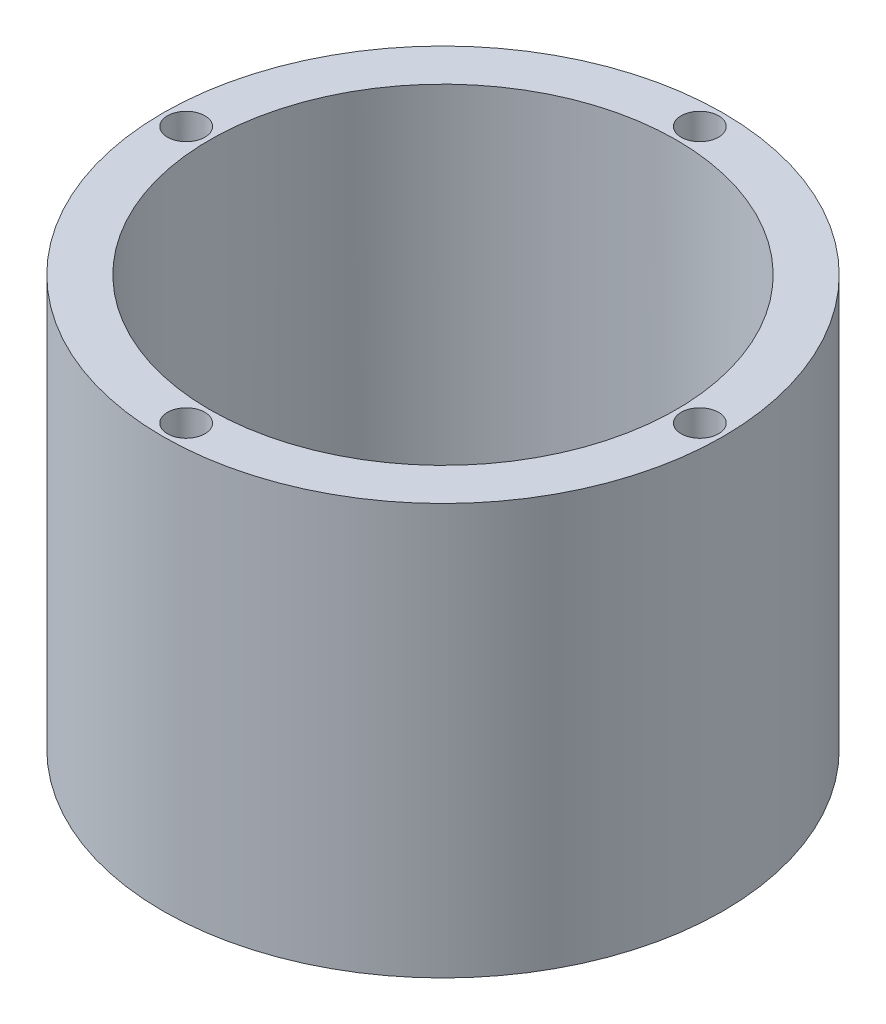
ISO-10303-21;
HEADER;
FILE_DESCRIPTION(('STEP AP214'),'2;1');
FILE_NAME('part.step','',(''),(''),'','','');
FILE_SCHEMA(('AUTOMOTIVE_DESIGN { 1 0 10303 214 1 1 1 1 }'));
ENDSEC;
DATA;
#1=APPLICATION_CONTEXT('core data for automotive mechanical design processes');
#2=APPLICATION_PROTOCOL_DEFINITION('international standard','automotive_design',2000,#1);
#3=PRODUCT_CONTEXT('',#1,'mechanical');
#4=PRODUCT('Part','Part','',(#3));
#5=PRODUCT_RELATED_PRODUCT_CATEGORY('part','',(#4));
#6=PRODUCT_DEFINITION_FORMATION('','',#4);
#7=PRODUCT_DEFINITION_CONTEXT('part definition',#1,'design');
#8=PRODUCT_DEFINITION('design','',#6,#7);
#9=PRODUCT_DEFINITION_SHAPE('','',#8);
#10=(LENGTH_UNIT() NAMED_UNIT(*) SI_UNIT(.MILLI.,.METRE.));
#11=(NAMED_UNIT(*) PLANE_ANGLE_UNIT() SI_UNIT($,.RADIAN.));
#12=(NAMED_UNIT(*) SI_UNIT($,.STERADIAN.) SOLID_ANGLE_UNIT());
#13=UNCERTAINTY_MEASURE_WITH_UNIT(LENGTH_MEASURE(1.E-05),#10,'distance_accuracy_value','');
#14=(GEOMETRIC_REPRESENTATION_CONTEXT(3) GLOBAL_UNCERTAINTY_ASSIGNED_CONTEXT((#13)) GLOBAL_UNIT_ASSIGNED_CONTEXT((#10,
#11,#12)) REPRESENTATION_CONTEXT('',''));
#15=CARTESIAN_POINT('',(0.,0.,0.));
#16=DIRECTION('',(0.,0.,1.));
#17=DIRECTION('',(1.,0.,0.));
#18=AXIS2_PLACEMENT_3D('',#15,#16,#17);
#19=CARTESIAN_POINT('',(0.,-4.,0.));
#20=DIRECTION('',(0.,1.,0.));
#21=DIRECTION('',(0.,0.,1.));
#22=AXIS2_PLACEMENT_3D('',#19,#20,#21);
#23=CYLINDRICAL_SURFACE('',#22,30.);
#24=CARTESIAN_POINT('',(0.,-4.,0.));
#25=DIRECTION('',(0.,1.,0.));
#26=DIRECTION('',(0.,0.,1.));
#27=AXIS2_PLACEMENT_3D('',#24,#25,#26);
#28=CIRCLE('',#27,30.);
#29=CARTESIAN_POINT('',(0.,-4.,30.));
#30=VERTEX_POINT('',#29);
#31=EDGE_CURVE('E48',#30,#30,#28,.T.);
#32=ORIENTED_EDGE('',*,*,#31,.T.);
#33=EDGE_LOOP('',(#32));
#34=FACE_BOUND('',#33,.T.);
#35=CARTESIAN_POINT('',(0.,40.,0.));
#36=DIRECTION('',(0.,-1.,0.));
#37=DIRECTION('',(0.,0.,-1.));
#38=AXIS2_PLACEMENT_3D('',#35,#36,#37);
#39=CIRCLE('',#38,30.);
#40=CARTESIAN_POINT('',(0.,40.,-30.));
#41=VERTEX_POINT('',#40);
#42=EDGE_CURVE('E296',#41,#41,#39,.F.);
#43=ORIENTED_EDGE('',*,*,#42,.F.);
#44=EDGE_LOOP('',(#43));
#45=FACE_BOUND('',#44,.T.);
#46=ADVANCED_FACE('F40',(#34,#45),#23,.T.);
#47=CARTESIAN_POINT('',(0.,80.,0.));
#48=DIRECTION('',(0.,1.,0.));
#49=DIRECTION('',(0.,0.,1.));
#50=AXIS2_PLACEMENT_3D('',#47,#48,#49);
#51=CYLINDRICAL_SURFACE('',#50,25.);
#52=CARTESIAN_POINT('',(0.,0.,0.));
#53=DIRECTION('',(0.,1.,0.));
#54=DIRECTION('',(0.,0.,1.));
#55=AXIS2_PLACEMENT_3D('',#52,#53,#54);
#56=CIRCLE('',#55,25.);
#57=CARTESIAN_POINT('',(0.,0.,25.));
#58=VERTEX_POINT('',#57);
#59=EDGE_CURVE('E284',#58,#58,#56,.T.);
#60=ORIENTED_EDGE('',*,*,#59,.F.);
#61=EDGE_LOOP('',(#60));
#62=FACE_BOUND('',#61,.T.);
#63=CARTESIAN_POINT('',(0.,40.,0.));
#64=DIRECTION('',(0.,-1.,0.));
#65=DIRECTION('',(0.,0.,-1.));
#66=AXIS2_PLACEMENT_3D('',#63,#64,#65);
#67=CIRCLE('',#66,25.);
#68=CARTESIAN_POINT('',(0.,40.,-25.));
#69=VERTEX_POINT('',#68);
#70=EDGE_CURVE('E310',#69,#69,#67,.F.);
#71=ORIENTED_EDGE('',*,*,#70,.T.);
#72=EDGE_LOOP('',(#71));
#73=FACE_BOUND('',#72,.T.);
#74=ADVANCED_FACE('F211',(#62,#73),#51,.F.);
#75=CARTESIAN_POINT('',(-27.5,34.,-1.92031473636372E-13));
#76=DIRECTION('',(0.,1.,0.));
#77=DIRECTION('',(0.,0.,1.));
#78=AXIS2_PLACEMENT_3D('',#75,#76,#77);
#79=CYLINDRICAL_SURFACE('',#78,2.);
#80=CARTESIAN_POINT('',(-27.5,34.,-1.92031473636372E-13));
#81=DIRECTION('',(0.,1.,0.));
#82=DIRECTION('',(0.,0.,1.));
#83=AXIS2_PLACEMENT_3D('',#80,#81,#82);
#84=CIRCLE('',#83,2.);
#85=CARTESIAN_POINT('',(-27.5,34.,1.99999999999981));
#86=VERTEX_POINT('',#85);
#87=EDGE_CURVE('E295',#86,#86,#84,.T.);
#88=ORIENTED_EDGE('',*,*,#87,.F.);
#89=EDGE_LOOP('',(#88));
#90=FACE_BOUND('',#89,.T.);
#91=CARTESIAN_POINT('',(-27.5,40.,-1.92031473636372E-13));
#92=DIRECTION('',(0.,-1.,0.));
#93=DIRECTION('',(0.,0.,-1.));
#94=AXIS2_PLACEMENT_3D('',#91,#92,#93);
#95=CIRCLE('',#94,2.);
#96=CARTESIAN_POINT('',(-27.5,40.,-2.00000000000019));
#97=VERTEX_POINT('',#96);
#98=EDGE_CURVE('E318',#97,#97,#95,.F.);
#99=ORIENTED_EDGE('',*,*,#98,.T.);
#100=EDGE_LOOP('',(#99));
#101=FACE_BOUND('',#100,.T.);
#102=ADVANCED_FACE('F215',(#90,#101),#79,.F.);
#103=CARTESIAN_POINT('',(27.5,34.,0.));
#104=DIRECTION('',(0.,1.,0.));
#105=DIRECTION('',(0.,0.,1.));
#106=AXIS2_PLACEMENT_3D('',#103,#104,#105);
#107=CYLINDRICAL_SURFACE('',#106,2.);
#108=CARTESIAN_POINT('',(27.5,34.,0.));
#109=DIRECTION('',(0.,1.,0.));
#110=DIRECTION('',(0.,0.,1.));
#111=AXIS2_PLACEMENT_3D('',#108,#109,#110);
#112=CIRCLE('',#111,2.);
#113=CARTESIAN_POINT('',(27.5,34.,2.));
#114=VERTEX_POINT('',#113);
#115=EDGE_CURVE('E290',#114,#114,#112,.T.);
#116=ORIENTED_EDGE('',*,*,#115,.F.);
#117=EDGE_LOOP('',(#116));
#118=FACE_BOUND('',#117,.T.);
#119=CARTESIAN_POINT('',(27.5,40.,0.));
#120=DIRECTION('',(0.,-1.,0.));
#121=DIRECTION('',(0.,0.,-1.));
#122=AXIS2_PLACEMENT_3D('',#119,#120,#121);
#123=CIRCLE('',#122,2.);
#124=CARTESIAN_POINT('',(27.5,40.,-2.));
#125=VERTEX_POINT('',#124);
#126=EDGE_CURVE('E11',#125,#125,#123,.F.);
#127=ORIENTED_EDGE('',*,*,#126,.T.);
#128=EDGE_LOOP('',(#127));
#129=FACE_BOUND('',#128,.T.);
#130=ADVANCED_FACE('F207',(#118,#129),#107,.F.);
#131=CARTESIAN_POINT('',(0.,0.,0.));
#132=DIRECTION('',(0.,1.,0.));
#133=DIRECTION('',(0.,0.,1.));
#134=AXIS2_PLACEMENT_3D('',#131,#132,#133);
#135=PLANE('',#134);
#136=DIRECTION('',(-0.99775519425491,0.,-0.0669669495896807));
#137=VECTOR('',#136,1.);
#138=CARTESIAN_POINT('',(1.92939965968181,0.,-3.178620376083));
#139=LINE('',#138,#137);
#140=CARTESIAN_POINT('',(18.,0.,-2.1));
#141=VERTEX_POINT('',#140);
#142=CARTESIAN_POINT('',(1.9293996596818,0.,-3.17862037608299));
#143=VERTEX_POINT('',#142);
#144=EDGE_CURVE('E55',#141,#143,#139,.T.);
#145=ORIENTED_EDGE('',*,*,#144,.F.);
#146=DIRECTION('',(0.,0.,-1.));
#147=VECTOR('',#146,1.);
#148=CARTESIAN_POINT('',(18.,0.,2.1));
#149=LINE('',#148,#147);
#150=CARTESIAN_POINT('',(18.,0.,2.1));
#151=VERTEX_POINT('',#150);
#152=EDGE_CURVE('E169',#151,#141,#149,.T.);
#153=ORIENTED_EDGE('',*,*,#152,.F.);
#154=DIRECTION('',(0.99775519425491,0.,-0.0669669495896807));
#155=VECTOR('',#154,1.);
#156=CARTESIAN_POINT('',(1.92939965968181,0.,3.178620376083));
#157=LINE('',#156,#155);
#158=CARTESIAN_POINT('',(1.92939965968181,0.,3.178620376083));
#159=VERTEX_POINT('',#158);
#160=EDGE_CURVE('E166',#159,#151,#157,.T.);
#161=ORIENTED_EDGE('',*,*,#160,.F.);
#162=CARTESIAN_POINT('',(0.,0.,0.));
#163=DIRECTION('',(0.,1.,0.));
#164=DIRECTION('',(0.,0.,-1.));
#165=AXIS2_PLACEMENT_3D('',#162,#163,#164);
#166=CIRCLE('',#165,3.71836127104801);
#167=CARTESIAN_POINT('',(-1.92939965968181,0.,3.17862037608301));
#168=VERTEX_POINT('',#167);
#169=EDGE_CURVE('E115',#168,#159,#166,.T.);
#170=ORIENTED_EDGE('',*,*,#169,.F.);
#171=DIRECTION('',(0.99775519425491,0.,0.0669669495896807));
#172=VECTOR('',#171,1.);
#173=CARTESIAN_POINT('',(-1.92939965968181,0.,3.178620376083));
#174=LINE('',#173,#172);
#175=CARTESIAN_POINT('',(-18.,0.,2.1));
#176=VERTEX_POINT('',#175);
#177=EDGE_CURVE('E160',#176,#168,#174,.T.);
#178=ORIENTED_EDGE('',*,*,#177,.F.);
#179=DIRECTION('',(0.,0.,1.));
#180=VECTOR('',#179,1.);
#181=CARTESIAN_POINT('',(-18.,0.,2.1));
#182=LINE('',#181,#180);
#183=CARTESIAN_POINT('',(-18.,0.,-2.1));
#184=VERTEX_POINT('',#183);
#185=EDGE_CURVE('E156',#184,#176,#182,.T.);
#186=ORIENTED_EDGE('',*,*,#185,.F.);
#187=DIRECTION('',(-0.99775519425491,0.,0.0669669495896807));
#188=VECTOR('',#187,1.);
#189=CARTESIAN_POINT('',(-1.92939965968181,0.,-3.178620376083));
#190=LINE('',#189,#188);
#191=CARTESIAN_POINT('',(-1.92939965968181,0.,-3.178620376083));
#192=VERTEX_POINT('',#191);
#193=EDGE_CURVE('E152',#192,#184,#190,.T.);
#194=ORIENTED_EDGE('',*,*,#193,.F.);
#195=CARTESIAN_POINT('',(0.,0.,0.));
#196=DIRECTION('',(0.,1.,0.));
#197=DIRECTION('',(0.,0.,1.));
#198=AXIS2_PLACEMENT_3D('',#195,#196,#197);
#199=CIRCLE('',#198,3.71836127104815);
#200=EDGE_CURVE('E147',#143,#192,#199,.T.);
#201=ORIENTED_EDGE('',*,*,#200,.F.);
#202=EDGE_LOOP('',(#145,#153,#161,#170,#178,#186,#194,#201));
#203=FACE_BOUND('',#202,.T.);
#204=ORIENTED_EDGE('',*,*,#59,.T.);
#205=EDGE_LOOP('',(#204));
#206=FACE_BOUND('',#205,.T.);
#207=ADVANCED_FACE('F198',(#203,#206),#135,.T.);
#208=CARTESIAN_POINT('',(0.,-4.,0.));
#209=DIRECTION('',(0.,1.,0.));
#210=DIRECTION('',(0.,0.,1.));
#211=AXIS2_PLACEMENT_3D('',#208,#209,#210);
#212=PLANE('',#211);
#213=CARTESIAN_POINT('',(0.,-4.,0.));
#214=DIRECTION('',(0.,1.,0.));
#215=DIRECTION('',(0.,0.,1.));
#216=AXIS2_PLACEMENT_3D('',#213,#214,#215);
#217=CIRCLE('',#216,3.7);
#218=CARTESIAN_POINT('',(0.,-4.,3.7));
#219=VERTEX_POINT('',#218);
#220=EDGE_CURVE('E148',#219,#219,#217,.T.);
#221=ORIENTED_EDGE('',*,*,#220,.T.);
#222=EDGE_LOOP('',(#221));
#223=FACE_BOUND('',#222,.T.);
#224=ORIENTED_EDGE('',*,*,#31,.F.);
#225=EDGE_LOOP('',(#224));
#226=FACE_BOUND('',#225,.T.);
#227=ADVANCED_FACE('F195',(#223,#226),#212,.F.);
#228=CARTESIAN_POINT('',(1.92939965968181,-1.,-3.178620376083));
#229=DIRECTION('',(0.0669669495896807,0.,-0.99775519425491));
#230=DIRECTION('',(-0.99775519425491,0.,-0.0669669495896807));
#231=AXIS2_PLACEMENT_3D('',#228,#229,#230);
#232=PLANE('',#231);
#233=ORIENTED_EDGE('',*,*,#144,.T.);
#234=DIRECTION('',(0.,1.,0.));
#235=VECTOR('',#234,1.);
#236=CARTESIAN_POINT('',(1.9293996596818,-1.,-3.17862037608299));
#237=LINE('',#236,#235);
#238=CARTESIAN_POINT('',(1.9293996596818,-1.,-3.17862037608299));
#239=VERTEX_POINT('',#238);
#240=EDGE_CURVE('E91',#239,#143,#237,.T.);
#241=ORIENTED_EDGE('',*,*,#240,.F.);
#242=DIRECTION('',(-0.99775519425491,0.,-0.0669669495896807));
#243=VECTOR('',#242,1.);
#244=CARTESIAN_POINT('',(1.92939965968181,-1.,-3.178620376083));
#245=LINE('',#244,#243);
#246=CARTESIAN_POINT('',(18.,-1.,-2.1));
#247=VERTEX_POINT('',#246);
#248=EDGE_CURVE('E172',#247,#239,#245,.T.);
#249=ORIENTED_EDGE('',*,*,#248,.F.);
#250=DIRECTION('',(0.,1.,0.));
#251=VECTOR('',#250,1.);
#252=CARTESIAN_POINT('',(18.,-1.,-2.1));
#253=LINE('',#252,#251);
#254=EDGE_CURVE('E63',#247,#141,#253,.T.);
#255=ORIENTED_EDGE('',*,*,#254,.T.);
#256=EDGE_LOOP('',(#233,#241,#249,#255));
#257=FACE_BOUND('',#256,.T.);
#258=ADVANCED_FACE('F197',(#257),#232,.F.);
#259=CARTESIAN_POINT('',(18.,-1.,2.1));
#260=DIRECTION('',(1.,0.,0.));
#261=DIRECTION('',(0.,0.,-1.));
#262=AXIS2_PLACEMENT_3D('',#259,#260,#261);
#263=PLANE('',#262);
#264=ORIENTED_EDGE('',*,*,#152,.T.);
#265=ORIENTED_EDGE('',*,*,#254,.F.);
#266=DIRECTION('',(0.,0.,-1.));
#267=VECTOR('',#266,1.);
#268=CARTESIAN_POINT('',(18.,-1.,2.1));
#269=LINE('',#268,#267);
#270=CARTESIAN_POINT('',(18.,-1.,2.1));
#271=VERTEX_POINT('',#270);
#272=EDGE_CURVE('E129',#271,#247,#269,.T.);
#273=ORIENTED_EDGE('',*,*,#272,.F.);
#274=DIRECTION('',(0.,1.,0.));
#275=VECTOR('',#274,1.);
#276=CARTESIAN_POINT('',(18.,-1.,2.1));
#277=LINE('',#276,#275);
#278=EDGE_CURVE('E120',#271,#151,#277,.T.);
#279=ORIENTED_EDGE('',*,*,#278,.T.);
#280=EDGE_LOOP('',(#264,#265,#273,#279));
#281=FACE_BOUND('',#280,.T.);
#282=ADVANCED_FACE('F205',(#281),#263,.F.);
#283=CARTESIAN_POINT('',(1.92939965968181,-1.,3.178620376083));
#284=DIRECTION('',(0.0669669495896807,0.,0.99775519425491));
#285=DIRECTION('',(0.99775519425491,0.,-0.0669669495896807));
#286=AXIS2_PLACEMENT_3D('',#283,#284,#285);
#287=PLANE('',#286);
#288=ORIENTED_EDGE('',*,*,#160,.T.);
#289=ORIENTED_EDGE('',*,*,#278,.F.);
#290=DIRECTION('',(0.99775519425491,0.,-0.0669669495896807));
#291=VECTOR('',#290,1.);
#292=CARTESIAN_POINT('',(1.92939965968181,-1.,3.178620376083));
#293=LINE('',#292,#291);
#294=CARTESIAN_POINT('',(1.92939965968181,-1.,3.178620376083));
#295=VERTEX_POINT('',#294);
#296=EDGE_CURVE('E124',#295,#271,#293,.T.);
#297=ORIENTED_EDGE('',*,*,#296,.F.);
#298=DIRECTION('',(0.,1.,0.));
#299=VECTOR('',#298,1.);
#300=CARTESIAN_POINT('',(1.92939965968181,-1.,3.178620376083));
#301=LINE('',#300,#299);
#302=EDGE_CURVE('E108',#295,#159,#301,.T.);
#303=ORIENTED_EDGE('',*,*,#302,.T.);
#304=EDGE_LOOP('',(#288,#289,#297,#303));
#305=FACE_BOUND('',#304,.T.);
#306=ADVANCED_FACE('F125',(#305),#287,.F.);
#307=CARTESIAN_POINT('',(0.,-1.,0.));
#308=DIRECTION('',(0.,1.,0.));
#309=DIRECTION('',(0.,0.,1.));
#310=AXIS2_PLACEMENT_3D('',#307,#308,#309);
#311=CYLINDRICAL_SURFACE('',#310,3.71836127104801);
#312=ORIENTED_EDGE('',*,*,#169,.T.);
#313=ORIENTED_EDGE('',*,*,#302,.F.);
#314=CARTESIAN_POINT('',(0.,-1.,0.));
#315=DIRECTION('',(0.,1.,0.));
#316=DIRECTION('',(0.,0.,-1.));
#317=AXIS2_PLACEMENT_3D('',#314,#315,#316);
#318=CIRCLE('',#317,3.71836127104801);
#319=CARTESIAN_POINT('',(-1.92939965968181,-1.,3.17862037608301));
#320=VERTEX_POINT('',#319);
#321=EDGE_CURVE('E112',#320,#295,#318,.T.);
#322=ORIENTED_EDGE('',*,*,#321,.F.);
#323=DIRECTION('',(0.,1.,0.));
#324=VECTOR('',#323,1.);
#325=CARTESIAN_POINT('',(-1.92939965968181,-1.,3.17862037608301));
#326=LINE('',#325,#324);
#327=EDGE_CURVE('E121',#320,#168,#326,.T.);
#328=ORIENTED_EDGE('',*,*,#327,.T.);
#329=EDGE_LOOP('',(#312,#313,#322,#328));
#330=FACE_BOUND('',#329,.T.);
#331=ADVANCED_FACE('F110',(#330),#311,.F.);
#332=CARTESIAN_POINT('',(-1.92939965968181,-1.,3.178620376083));
#333=DIRECTION('',(-0.0669669495896807,0.,0.99775519425491));
#334=DIRECTION('',(0.99775519425491,0.,0.0669669495896807));
#335=AXIS2_PLACEMENT_3D('',#332,#333,#334);
#336=PLANE('',#335);
#337=ORIENTED_EDGE('',*,*,#177,.T.);
#338=ORIENTED_EDGE('',*,*,#327,.F.);
#339=DIRECTION('',(0.99775519425491,0.,0.0669669495896807));
#340=VECTOR('',#339,1.);
#341=CARTESIAN_POINT('',(-1.92939965968181,-1.,3.178620376083));
#342=LINE('',#341,#340);
#343=CARTESIAN_POINT('',(-18.,-1.,2.1));
#344=VERTEX_POINT('',#343);
#345=EDGE_CURVE('E135',#344,#320,#342,.T.);
#346=ORIENTED_EDGE('',*,*,#345,.F.);
#347=DIRECTION('',(0.,1.,0.));
#348=VECTOR('',#347,1.);
#349=CARTESIAN_POINT('',(-18.,-1.,2.1));
#350=LINE('',#349,#348);
#351=EDGE_CURVE('E179',#344,#176,#350,.T.);
#352=ORIENTED_EDGE('',*,*,#351,.T.);
#353=EDGE_LOOP('',(#337,#338,#346,#352));
#354=FACE_BOUND('',#353,.T.);
#355=ADVANCED_FACE('F244',(#354),#336,.F.);
#356=CARTESIAN_POINT('',(-18.,-1.,2.1));
#357=DIRECTION('',(-1.,0.,0.));
#358=DIRECTION('',(0.,0.,1.));
#359=AXIS2_PLACEMENT_3D('',#356,#357,#358);
#360=PLANE('',#359);
#361=ORIENTED_EDGE('',*,*,#185,.T.);
#362=ORIENTED_EDGE('',*,*,#351,.F.);
#363=DIRECTION('',(0.,0.,1.));
#364=VECTOR('',#363,1.);
#365=CARTESIAN_POINT('',(-18.,-1.,2.1));
#366=LINE('',#365,#364);
#367=CARTESIAN_POINT('',(-18.,-1.,-2.1));
#368=VERTEX_POINT('',#367);
#369=EDGE_CURVE('E139',#368,#344,#366,.T.);
#370=ORIENTED_EDGE('',*,*,#369,.F.);
#371=DIRECTION('',(0.,1.,0.));
#372=VECTOR('',#371,1.);
#373=CARTESIAN_POINT('',(-18.,-1.,-2.1));
#374=LINE('',#373,#372);
#375=EDGE_CURVE('E182',#368,#184,#374,.T.);
#376=ORIENTED_EDGE('',*,*,#375,.T.);
#377=EDGE_LOOP('',(#361,#362,#370,#376));
#378=FACE_BOUND('',#377,.T.);
#379=ADVANCED_FACE('F247',(#378),#360,.F.);
#380=CARTESIAN_POINT('',(-1.92939965968181,-1.,-3.178620376083));
#381=DIRECTION('',(-0.0669669495896807,0.,-0.99775519425491));
#382=DIRECTION('',(-0.99775519425491,0.,0.0669669495896807));
#383=AXIS2_PLACEMENT_3D('',#380,#381,#382);
#384=PLANE('',#383);
#385=ORIENTED_EDGE('',*,*,#193,.T.);
#386=ORIENTED_EDGE('',*,*,#375,.F.);
#387=DIRECTION('',(-0.99775519425491,0.,0.0669669495896807));
#388=VECTOR('',#387,1.);
#389=CARTESIAN_POINT('',(-1.92939965968181,-1.,-3.178620376083));
#390=LINE('',#389,#388);
#391=CARTESIAN_POINT('',(-1.92939965968181,-1.,-3.178620376083));
#392=VERTEX_POINT('',#391);
#393=EDGE_CURVE('E268',#392,#368,#390,.T.);
#394=ORIENTED_EDGE('',*,*,#393,.F.);
#395=DIRECTION('',(0.,1.,0.));
#396=VECTOR('',#395,1.);
#397=CARTESIAN_POINT('',(-1.92939965968181,-1.,-3.178620376083));
#398=LINE('',#397,#396);
#399=EDGE_CURVE('E185',#392,#192,#398,.T.);
#400=ORIENTED_EDGE('',*,*,#399,.T.);
#401=EDGE_LOOP('',(#385,#386,#394,#400));
#402=FACE_BOUND('',#401,.T.);
#403=ADVANCED_FACE('F251',(#402),#384,.F.);
#404=CARTESIAN_POINT('',(0.,-1.,0.));
#405=DIRECTION('',(0.,1.,0.));
#406=DIRECTION('',(0.,0.,1.));
#407=AXIS2_PLACEMENT_3D('',#404,#405,#406);
#408=CYLINDRICAL_SURFACE('',#407,3.71836127104815);
#409=ORIENTED_EDGE('',*,*,#200,.T.);
#410=ORIENTED_EDGE('',*,*,#399,.F.);
#411=CARTESIAN_POINT('',(0.,-1.,0.));
#412=DIRECTION('',(0.,1.,0.));
#413=DIRECTION('',(0.,0.,1.));
#414=AXIS2_PLACEMENT_3D('',#411,#412,#413);
#415=CIRCLE('',#414,3.71836127104815);
#416=EDGE_CURVE('E271',#239,#392,#415,.T.);
#417=ORIENTED_EDGE('',*,*,#416,.F.);
#418=ORIENTED_EDGE('',*,*,#240,.T.);
#419=EDGE_LOOP('',(#409,#410,#417,#418));
#420=FACE_BOUND('',#419,.T.);
#421=ADVANCED_FACE('F236',(#420),#408,.F.);
#422=CARTESIAN_POINT('',(0.,-1.,0.));
#423=DIRECTION('',(0.,-1.,0.));
#424=DIRECTION('',(0.,0.,-1.));
#425=AXIS2_PLACEMENT_3D('',#422,#423,#424);
#426=PLANE('',#425);
#427=CARTESIAN_POINT('',(0.,-1.,0.));
#428=DIRECTION('',(0.,1.,0.));
#429=DIRECTION('',(0.,0.,1.));
#430=AXIS2_PLACEMENT_3D('',#427,#428,#429);
#431=CIRCLE('',#430,3.7);
#432=CARTESIAN_POINT('',(0.,-1.,3.7));
#433=VERTEX_POINT('',#432);
#434=EDGE_CURVE('E280',#433,#433,#431,.T.);
#435=ORIENTED_EDGE('',*,*,#434,.F.);
#436=EDGE_LOOP('',(#435));
#437=FACE_BOUND('',#436,.T.);
#438=ORIENTED_EDGE('',*,*,#248,.T.);
#439=ORIENTED_EDGE('',*,*,#416,.T.);
#440=ORIENTED_EDGE('',*,*,#393,.T.);
#441=ORIENTED_EDGE('',*,*,#369,.T.);
#442=ORIENTED_EDGE('',*,*,#345,.T.);
#443=ORIENTED_EDGE('',*,*,#321,.T.);
#444=ORIENTED_EDGE('',*,*,#296,.T.);
#445=ORIENTED_EDGE('',*,*,#272,.T.);
#446=EDGE_LOOP('',(#438,#439,#440,#441,#442,#443,#444,#445));
#447=FACE_BOUND('',#446,.T.);
#448=ADVANCED_FACE('F132',(#437,#447),#426,.F.);
#449=CARTESIAN_POINT('',(0.,-4.,0.));
#450=DIRECTION('',(0.,1.,0.));
#451=DIRECTION('',(0.,0.,1.));
#452=AXIS2_PLACEMENT_3D('',#449,#450,#451);
#453=CYLINDRICAL_SURFACE('',#452,3.7);
#454=ORIENTED_EDGE('',*,*,#220,.F.);
#455=EDGE_LOOP('',(#454));
#456=FACE_BOUND('',#455,.T.);
#457=ORIENTED_EDGE('',*,*,#434,.T.);
#458=EDGE_LOOP('',(#457));
#459=FACE_BOUND('',#458,.T.);
#460=ADVANCED_FACE('F229',(#456,#459),#453,.F.);
#461=CARTESIAN_POINT('',(-27.5,34.,-1.92031473636372E-13));
#462=DIRECTION('',(0.,1.,0.));
#463=DIRECTION('',(0.,0.,1.));
#464=AXIS2_PLACEMENT_3D('',#461,#462,#463);
#465=PLANE('',#464);
#466=ORIENTED_EDGE('',*,*,#87,.T.);
#467=EDGE_LOOP('',(#466));
#468=FACE_BOUND('',#467,.T.);
#469=ADVANCED_FACE('F232',(#468),#465,.T.);
#470=CARTESIAN_POINT('',(27.5,34.,0.));
#471=DIRECTION('',(0.,1.,0.));
#472=DIRECTION('',(0.,0.,1.));
#473=AXIS2_PLACEMENT_3D('',#470,#471,#472);
#474=PLANE('',#473);
#475=ORIENTED_EDGE('',*,*,#115,.T.);
#476=EDGE_LOOP('',(#475));
#477=FACE_BOUND('',#476,.T.);
#478=ADVANCED_FACE('F343',(#477),#474,.T.);
#479=CARTESIAN_POINT('',(-30.,40.,-30.));
#480=DIRECTION('',(0.,-1.,0.));
#481=DIRECTION('',(0.,0.,-1.));
#482=AXIS2_PLACEMENT_3D('',#479,#480,#481);
#483=PLANE('',#482);
#484=ORIENTED_EDGE('',*,*,#126,.F.);
#485=EDGE_LOOP('',(#484));
#486=FACE_BOUND('',#485,.T.);
#487=ORIENTED_EDGE('',*,*,#70,.F.);
#488=EDGE_LOOP('',(#487));
#489=FACE_BOUND('',#488,.T.);
#490=ORIENTED_EDGE('',*,*,#98,.F.);
#491=EDGE_LOOP('',(#490));
#492=FACE_BOUND('',#491,.T.);
#493=ORIENTED_EDGE('',*,*,#42,.T.);
#494=EDGE_LOOP('',(#493));
#495=FACE_BOUND('',#494,.T.);
#496=CARTESIAN_POINT('',(2.88047210454558E-13,40.,-27.5));
#497=DIRECTION('',(0.,-1.,0.));
#498=DIRECTION('',(0.,0.,-1.));
#499=AXIS2_PLACEMENT_3D('',#496,#497,#498);
#500=CIRCLE('',#499,2.);
#501=CARTESIAN_POINT('',(2.88047210454558E-13,40.,-29.5));
#502=VERTEX_POINT('',#501);
#503=EDGE_CURVE('E314',#502,#502,#500,.F.);
#504=ORIENTED_EDGE('',*,*,#503,.F.);
#505=EDGE_LOOP('',(#504));
#506=FACE_BOUND('',#505,.T.);
#507=CARTESIAN_POINT('',(0.,40.,27.5));
#508=DIRECTION('',(0.,1.,0.));
#509=DIRECTION('',(0.,0.,1.));
#510=AXIS2_PLACEMENT_3D('',#507,#508,#509);
#511=CIRCLE('',#510,2.);
#512=CARTESIAN_POINT('',(0.,40.,29.5));
#513=VERTEX_POINT('',#512);
#514=EDGE_CURVE('E322',#513,#513,#511,.F.);
#515=ORIENTED_EDGE('',*,*,#514,.T.);
#516=EDGE_LOOP('',(#515));
#517=FACE_BOUND('',#516,.T.);
#518=ADVANCED_FACE('F327',(#486,#489,#492,#495,#506,#517),#483,.F.);
#519=CARTESIAN_POINT('',(2.88047210454558E-13,34.,-27.5));
#520=DIRECTION('',(0.,1.,0.));
#521=DIRECTION('',(0.,0.,1.));
#522=AXIS2_PLACEMENT_3D('',#519,#520,#521);
#523=PLANE('',#522);
#524=CARTESIAN_POINT('',(2.88047210454558E-13,34.,-27.5));
#525=DIRECTION('',(0.,1.,0.));
#526=DIRECTION('',(0.,0.,1.));
#527=AXIS2_PLACEMENT_3D('',#524,#525,#526);
#528=CIRCLE('',#527,2.);
#529=CARTESIAN_POINT('',(2.88047210454558E-13,34.,-25.5));
#530=VERTEX_POINT('',#529);
#531=EDGE_CURVE('E291',#530,#530,#528,.T.);
#532=ORIENTED_EDGE('',*,*,#531,.T.);
#533=EDGE_LOOP('',(#532));
#534=FACE_BOUND('',#533,.T.);
#535=ADVANCED_FACE('F345',(#534),#523,.T.);
#536=CARTESIAN_POINT('',(2.88047210454558E-13,34.,-27.5));
#537=DIRECTION('',(0.,1.,0.));
#538=DIRECTION('',(0.,0.,1.));
#539=AXIS2_PLACEMENT_3D('',#536,#537,#538);
#540=CYLINDRICAL_SURFACE('',#539,2.);
#541=ORIENTED_EDGE('',*,*,#503,.T.);
#542=EDGE_LOOP('',(#541));
#543=FACE_BOUND('',#542,.T.);
#544=ORIENTED_EDGE('',*,*,#531,.F.);
#545=EDGE_LOOP('',(#544));
#546=FACE_BOUND('',#545,.T.);
#547=ADVANCED_FACE('F227',(#543,#546),#540,.F.);
#548=CARTESIAN_POINT('',(0.,34.,27.5));
#549=DIRECTION('',(0.,1.,0.));
#550=DIRECTION('',(0.,0.,1.));
#551=AXIS2_PLACEMENT_3D('',#548,#549,#550);
#552=PLANE('',#551);
#553=CARTESIAN_POINT('',(0.,34.,27.5));
#554=DIRECTION('',(0.,1.,0.));
#555=DIRECTION('',(0.,0.,1.));
#556=AXIS2_PLACEMENT_3D('',#553,#554,#555);
#557=CIRCLE('',#556,2.);
#558=CARTESIAN_POINT('',(0.,34.,29.5));
#559=VERTEX_POINT('',#558);
#560=EDGE_CURVE('E300',#559,#559,#557,.T.);
#561=ORIENTED_EDGE('',*,*,#560,.T.);
#562=EDGE_LOOP('',(#561));
#563=FACE_BOUND('',#562,.T.);
#564=ADVANCED_FACE('F331',(#563),#552,.T.);
#565=CARTESIAN_POINT('',(0.,34.,27.5));
#566=DIRECTION('',(0.,1.,0.));
#567=DIRECTION('',(0.,0.,1.));
#568=AXIS2_PLACEMENT_3D('',#565,#566,#567);
#569=CYLINDRICAL_SURFACE('',#568,2.);
#570=ORIENTED_EDGE('',*,*,#560,.F.);
#571=EDGE_LOOP('',(#570));
#572=FACE_BOUND('',#571,.T.);
#573=ORIENTED_EDGE('',*,*,#514,.F.);
#574=EDGE_LOOP('',(#573));
#575=FACE_BOUND('',#574,.T.);
#576=ADVANCED_FACE('F329',(#572,#575),#569,.F.);
#577=CLOSED_SHELL('',(#46,#74,#102,#130,#207,#227,#258,#282,#306,#331,#355,#379,#403,#421,#448,
#460,#469,#478,#518,#535,#547,#564,#576));
#578=MANIFOLD_SOLID_BREP('B2',#577);
#579=ADVANCED_BREP_SHAPE_REPRESENTATION('',(#18,#578),#14);
#580=SHAPE_DEFINITION_REPRESENTATION(#9,#579);
ENDSEC;
END-ISO-10303-21;
